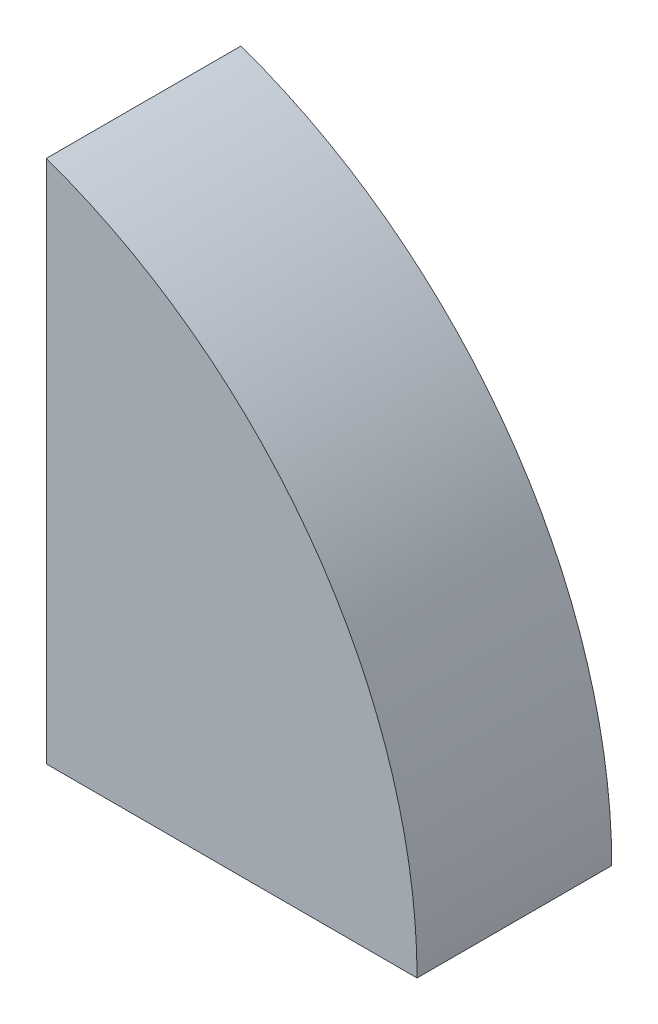
ISO-10303-21;
HEADER;
FILE_DESCRIPTION(('STEP AP214'),'2;1');
FILE_NAME('part.step','',(''),(''),'','','');
FILE_SCHEMA(('AUTOMOTIVE_DESIGN { 1 0 10303 214 1 1 1 1 }'));
ENDSEC;
DATA;
#1=APPLICATION_CONTEXT('core data for automotive mechanical design processes');
#2=APPLICATION_PROTOCOL_DEFINITION('international standard','automotive_design',2000,#1);
#3=PRODUCT_CONTEXT('',#1,'mechanical');
#4=PRODUCT('Part','Part','',(#3));
#5=PRODUCT_RELATED_PRODUCT_CATEGORY('part','',(#4));
#6=PRODUCT_DEFINITION_FORMATION('','',#4);
#7=PRODUCT_DEFINITION_CONTEXT('part definition',#1,'design');
#8=PRODUCT_DEFINITION('design','',#6,#7);
#9=PRODUCT_DEFINITION_SHAPE('','',#8);
#10=(LENGTH_UNIT() NAMED_UNIT(*) SI_UNIT(.MILLI.,.METRE.));
#11=(NAMED_UNIT(*) PLANE_ANGLE_UNIT() SI_UNIT($,.RADIAN.));
#12=(NAMED_UNIT(*) SI_UNIT($,.STERADIAN.) SOLID_ANGLE_UNIT());
#13=UNCERTAINTY_MEASURE_WITH_UNIT(LENGTH_MEASURE(1.E-05),#10,'distance_accuracy_value','');
#14=(GEOMETRIC_REPRESENTATION_CONTEXT(3) GLOBAL_UNCERTAINTY_ASSIGNED_CONTEXT((#13)) GLOBAL_UNIT_ASSIGNED_CONTEXT((#10,
#11,#12)) REPRESENTATION_CONTEXT('',''));
#15=CARTESIAN_POINT('',(0.,0.,0.));
#16=DIRECTION('',(0.,0.,1.));
#17=DIRECTION('',(1.,0.,0.));
#18=AXIS2_PLACEMENT_3D('',#15,#16,#17);
#19=CARTESIAN_POINT('',(75.116991160668,-169.122807017544,70.));
#20=DIRECTION('',(0.,0.,-1.));
#21=DIRECTION('',(-1.,0.,0.));
#22=AXIS2_PLACEMENT_3D('',#19,#20,#21);
#23=CYLINDRICAL_SURFACE('',#22,200.);
#24=CARTESIAN_POINT('',(75.116991160668,-169.122807017544,0.));
#25=DIRECTION('',(0.,0.,1.));
#26=DIRECTION('',(1.,0.,0.));
#27=AXIS2_PLACEMENT_3D('',#24,#25,#26);
#28=CIRCLE('',#27,200.);
#29=CARTESIAN_POINT('',(275.116991160668,-169.122807017544,0.));
#30=VERTEX_POINT('',#29);
#31=CARTESIAN_POINT('',(141.783657827335,19.4390012988688,0.));
#32=VERTEX_POINT('',#31);
#33=EDGE_CURVE('E80',#30,#32,#28,.T.);
#34=ORIENTED_EDGE('',*,*,#33,.T.);
#35=DIRECTION('',(0.,0.,-1.));
#36=VECTOR('',#35,1.);
#37=CARTESIAN_POINT('',(141.783657827335,19.4390012988688,70.));
#38=LINE('',#37,#36);
#39=CARTESIAN_POINT('',(141.783657827335,19.4390012988688,70.));
#40=VERTEX_POINT('',#39);
#41=EDGE_CURVE('E11',#40,#32,#38,.T.);
#42=ORIENTED_EDGE('',*,*,#41,.F.);
#43=CARTESIAN_POINT('',(75.116991160668,-169.122807017544,70.));
#44=DIRECTION('',(0.,0.,1.));
#45=DIRECTION('',(1.,0.,0.));
#46=AXIS2_PLACEMENT_3D('',#43,#44,#45);
#47=CIRCLE('',#46,200.);
#48=CARTESIAN_POINT('',(275.116991160668,-169.122807017544,70.));
#49=VERTEX_POINT('',#48);
#50=EDGE_CURVE('E73',#49,#40,#47,.T.);
#51=ORIENTED_EDGE('',*,*,#50,.F.);
#52=DIRECTION('',(0.,0.,-1.));
#53=VECTOR('',#52,1.);
#54=CARTESIAN_POINT('',(275.116991160668,-169.122807017544,70.));
#55=LINE('',#54,#53);
#56=EDGE_CURVE('E81',#49,#30,#55,.T.);
#57=ORIENTED_EDGE('',*,*,#56,.T.);
#58=EDGE_LOOP('',(#34,#42,#51,#57));
#59=FACE_BOUND('',#58,.T.);
#60=ADVANCED_FACE('F33',(#59),#23,.T.);
#61=CARTESIAN_POINT('',(141.783657827335,-169.122807017544,70.));
#62=DIRECTION('',(1.,0.,0.));
#63=DIRECTION('',(0.,0.,-1.));
#64=AXIS2_PLACEMENT_3D('',#61,#62,#63);
#65=PLANE('',#64);
#66=DIRECTION('',(0.,-1.,0.));
#67=VECTOR('',#66,1.);
#68=CARTESIAN_POINT('',(141.783657827335,-169.122807017544,0.));
#69=LINE('',#68,#67);
#70=CARTESIAN_POINT('',(141.783657827335,-169.122807017544,0.));
#71=VERTEX_POINT('',#70);
#72=EDGE_CURVE('E61',#32,#71,#69,.T.);
#73=ORIENTED_EDGE('',*,*,#72,.T.);
#74=DIRECTION('',(0.,0.,-1.));
#75=VECTOR('',#74,1.);
#76=CARTESIAN_POINT('',(141.783657827335,-169.122807017544,70.));
#77=LINE('',#76,#75);
#78=CARTESIAN_POINT('',(141.783657827335,-169.122807017544,70.));
#79=VERTEX_POINT('',#78);
#80=EDGE_CURVE('E41',#79,#71,#77,.T.);
#81=ORIENTED_EDGE('',*,*,#80,.F.);
#82=DIRECTION('',(0.,-1.,0.));
#83=VECTOR('',#82,1.);
#84=CARTESIAN_POINT('',(141.783657827335,-169.122807017544,70.));
#85=LINE('',#84,#83);
#86=EDGE_CURVE('E69',#40,#79,#85,.T.);
#87=ORIENTED_EDGE('',*,*,#86,.F.);
#88=ORIENTED_EDGE('',*,*,#41,.T.);
#89=EDGE_LOOP('',(#73,#81,#87,#88));
#90=FACE_BOUND('',#89,.T.);
#91=ADVANCED_FACE('F70',(#90),#65,.F.);
#92=CARTESIAN_POINT('',(141.783657827335,-169.122807017544,70.));
#93=DIRECTION('',(0.,1.,0.));
#94=DIRECTION('',(0.,0.,1.));
#95=AXIS2_PLACEMENT_3D('',#92,#93,#94);
#96=PLANE('',#95);
#97=DIRECTION('',(1.,0.,0.));
#98=VECTOR('',#97,1.);
#99=CARTESIAN_POINT('',(141.783657827335,-169.122807017544,0.));
#100=LINE('',#99,#98);
#101=EDGE_CURVE('E66',#71,#30,#100,.T.);
#102=ORIENTED_EDGE('',*,*,#101,.T.);
#103=ORIENTED_EDGE('',*,*,#56,.F.);
#104=DIRECTION('',(1.,0.,0.));
#105=VECTOR('',#104,1.);
#106=CARTESIAN_POINT('',(141.783657827335,-169.122807017544,70.));
#107=LINE('',#106,#105);
#108=EDGE_CURVE('E49',#79,#49,#107,.T.);
#109=ORIENTED_EDGE('',*,*,#108,.F.);
#110=ORIENTED_EDGE('',*,*,#80,.T.);
#111=EDGE_LOOP('',(#102,#103,#109,#110));
#112=FACE_BOUND('',#111,.T.);
#113=ADVANCED_FACE('F88',(#112),#96,.F.);
#114=CARTESIAN_POINT('',(75.116991160668,-169.122807017544,70.));
#115=DIRECTION('',(0.,0.,1.));
#116=DIRECTION('',(1.,0.,0.));
#117=AXIS2_PLACEMENT_3D('',#114,#115,#116);
#118=PLANE('',#117);
#119=ORIENTED_EDGE('',*,*,#50,.T.);
#120=ORIENTED_EDGE('',*,*,#86,.T.);
#121=ORIENTED_EDGE('',*,*,#108,.T.);
#122=EDGE_LOOP('',(#119,#120,#121));
#123=FACE_BOUND('',#122,.T.);
#124=ADVANCED_FACE('F76',(#123),#118,.T.);
#125=CARTESIAN_POINT('',(75.116991160668,-169.122807017544,0.));
#126=DIRECTION('',(0.,0.,1.));
#127=DIRECTION('',(1.,0.,0.));
#128=AXIS2_PLACEMENT_3D('',#125,#126,#127);
#129=PLANE('',#128);
#130=ORIENTED_EDGE('',*,*,#33,.F.);
#131=ORIENTED_EDGE('',*,*,#101,.F.);
#132=ORIENTED_EDGE('',*,*,#72,.F.);
#133=EDGE_LOOP('',(#130,#131,#132));
#134=FACE_BOUND('',#133,.T.);
#135=ADVANCED_FACE('F89',(#134),#129,.F.);
#136=CLOSED_SHELL('',(#60,#91,#113,#124,#135));
#137=MANIFOLD_SOLID_BREP('B2',#136);
#138=ADVANCED_BREP_SHAPE_REPRESENTATION('',(#18,#137),#14);
#139=SHAPE_DEFINITION_REPRESENTATION(#9,#138);
ENDSEC;
END-ISO-10303-21;
